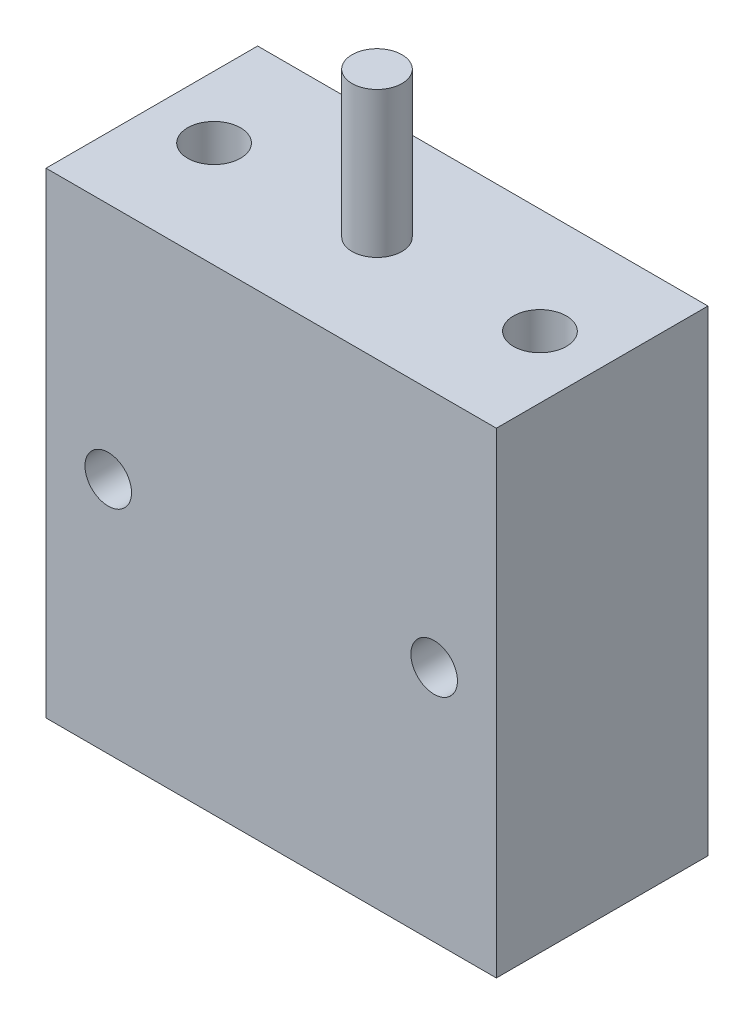
ISO-10303-21;
HEADER;
FILE_DESCRIPTION(('STEP AP214'),'2;1');
FILE_NAME('part.step','',(''),(''),'','','');
FILE_SCHEMA(('AUTOMOTIVE_DESIGN { 1 0 10303 214 1 1 1 1 }'));
ENDSEC;
DATA;
#1=APPLICATION_CONTEXT('core data for automotive mechanical design processes');
#2=APPLICATION_PROTOCOL_DEFINITION('international standard','automotive_design',2000,#1);
#3=PRODUCT_CONTEXT('',#1,'mechanical');
#4=PRODUCT('Part','Part','',(#3));
#5=PRODUCT_RELATED_PRODUCT_CATEGORY('part','',(#4));
#6=PRODUCT_DEFINITION_FORMATION('','',#4);
#7=PRODUCT_DEFINITION_CONTEXT('part definition',#1,'design');
#8=PRODUCT_DEFINITION('design','',#6,#7);
#9=PRODUCT_DEFINITION_SHAPE('','',#8);
#10=(LENGTH_UNIT() NAMED_UNIT(*) SI_UNIT(.MILLI.,.METRE.));
#11=(NAMED_UNIT(*) PLANE_ANGLE_UNIT() SI_UNIT($,.RADIAN.));
#12=(NAMED_UNIT(*) SI_UNIT($,.STERADIAN.) SOLID_ANGLE_UNIT());
#13=UNCERTAINTY_MEASURE_WITH_UNIT(LENGTH_MEASURE(1.E-05),#10,'distance_accuracy_value','');
#14=(GEOMETRIC_REPRESENTATION_CONTEXT(3) GLOBAL_UNCERTAINTY_ASSIGNED_CONTEXT((#13)) GLOBAL_UNIT_ASSIGNED_CONTEXT((#10,
#11,#12)) REPRESENTATION_CONTEXT('',''));
#15=CARTESIAN_POINT('',(0.,0.,0.));
#16=DIRECTION('',(0.,0.,1.));
#17=DIRECTION('',(1.,0.,0.));
#18=AXIS2_PLACEMENT_3D('',#15,#16,#17);
#19=CARTESIAN_POINT('',(-13.5128,38.5572,12.7));
#20=DIRECTION('',(0.,-1.,0.));
#21=DIRECTION('',(0.,0.,-1.));
#22=AXIS2_PLACEMENT_3D('',#19,#20,#21);
#23=PLANE('',#22);
#24=CARTESIAN_POINT('',(-9.779,38.5572,6.35));
#25=DIRECTION('',(0.,1.,0.));
#26=DIRECTION('',(0.,0.,-1.));
#27=AXIS2_PLACEMENT_3D('',#24,#25,#26);
#28=CIRCLE('',#27,1.5875);
#29=CARTESIAN_POINT('',(-9.779,38.5572,4.7625));
#30=VERTEX_POINT('',#29);
#31=EDGE_CURVE('E471',#30,#30,#28,.T.);
#32=ORIENTED_EDGE('',*,*,#31,.F.);
#33=EDGE_LOOP('',(#32));
#34=FACE_BOUND('',#33,.T.);
#35=CARTESIAN_POINT('',(9.779,38.5572,6.35));
#36=DIRECTION('',(0.,1.,0.));
#37=DIRECTION('',(0.,0.,1.));
#38=AXIS2_PLACEMENT_3D('',#35,#36,#37);
#39=CIRCLE('',#38,1.5875);
#40=CARTESIAN_POINT('',(9.779,38.5572,7.9375));
#41=VERTEX_POINT('',#40);
#42=EDGE_CURVE('E465',#41,#41,#39,.T.);
#43=ORIENTED_EDGE('',*,*,#42,.F.);
#44=EDGE_LOOP('',(#43));
#45=FACE_BOUND('',#44,.T.);
#46=DIRECTION('',(-1.,0.,0.));
#47=VECTOR('',#46,1.);
#48=CARTESIAN_POINT('',(-13.5128,38.5572,0.));
#49=LINE('',#48,#47);
#50=CARTESIAN_POINT('',(13.5128,38.5572,0.));
#51=VERTEX_POINT('',#50);
#52=CARTESIAN_POINT('',(-13.5128,38.5572,0.));
#53=VERTEX_POINT('',#52);
#54=EDGE_CURVE('E429',#51,#53,#49,.T.);
#55=ORIENTED_EDGE('',*,*,#54,.T.);
#56=DIRECTION('',(0.,0.,-1.));
#57=VECTOR('',#56,1.);
#58=CARTESIAN_POINT('',(-13.5128,38.5572,12.7));
#59=LINE('',#58,#57);
#60=CARTESIAN_POINT('',(-13.5128,38.5572,12.7));
#61=VERTEX_POINT('',#60);
#62=EDGE_CURVE('E420',#61,#53,#59,.T.);
#63=ORIENTED_EDGE('',*,*,#62,.F.);
#64=DIRECTION('',(-1.,0.,0.));
#65=VECTOR('',#64,1.);
#66=CARTESIAN_POINT('',(-13.5128,38.5572,12.7));
#67=LINE('',#66,#65);
#68=CARTESIAN_POINT('',(13.5128,38.5572,12.7));
#69=VERTEX_POINT('',#68);
#70=EDGE_CURVE('E375',#69,#61,#67,.T.);
#71=ORIENTED_EDGE('',*,*,#70,.F.);
#72=DIRECTION('',(0.,0.,-1.));
#73=VECTOR('',#72,1.);
#74=CARTESIAN_POINT('',(13.5128,38.5572,12.7));
#75=LINE('',#74,#73);
#76=EDGE_CURVE('E437',#69,#51,#75,.T.);
#77=ORIENTED_EDGE('',*,*,#76,.T.);
#78=EDGE_LOOP('',(#55,#63,#71,#77));
#79=FACE_BOUND('',#78,.T.);
#80=CARTESIAN_POINT('',(0.,38.5572,6.35));
#81=DIRECTION('',(0.,-1.,0.));
#82=DIRECTION('',(0.,0.,-1.));
#83=AXIS2_PLACEMENT_3D('',#80,#81,#82);
#84=CIRCLE('',#83,1.4986);
#85=CARTESIAN_POINT('',(0.,38.5572,4.8514));
#86=VERTEX_POINT('',#85);
#87=EDGE_CURVE('E11',#86,#86,#84,.F.);
#88=ORIENTED_EDGE('',*,*,#87,.F.);
#89=EDGE_LOOP('',(#88));
#90=FACE_BOUND('',#89,.T.);
#91=ADVANCED_FACE('F360',(#34,#45,#79,#90),#23,.F.);
#92=CARTESIAN_POINT('',(-13.5128,9.9822,12.7));
#93=DIRECTION('',(0.,0.,1.));
#94=DIRECTION('',(1.,0.,0.));
#95=AXIS2_PLACEMENT_3D('',#92,#93,#94);
#96=PLANE('',#95);
#97=CARTESIAN_POINT('',(-9.779,24.257,12.7));
#98=DIRECTION('',(0.,0.,1.));
#99=DIRECTION('',(1.,0.,0.));
#100=AXIS2_PLACEMENT_3D('',#97,#98,#99);
#101=CIRCLE('',#100,1.397);
#102=CARTESIAN_POINT('',(-8.382,24.257,12.7));
#103=VERTEX_POINT('',#102);
#104=EDGE_CURVE('E421',#103,#103,#101,.T.);
#105=ORIENTED_EDGE('',*,*,#104,.F.);
#106=EDGE_LOOP('',(#105));
#107=FACE_BOUND('',#106,.T.);
#108=DIRECTION('',(0.,-1.,0.));
#109=VECTOR('',#108,1.);
#110=CARTESIAN_POINT('',(-13.5128,38.5572,12.7));
#111=LINE('',#110,#109);
#112=CARTESIAN_POINT('',(-13.5128,9.9822,12.7));
#113=VERTEX_POINT('',#112);
#114=EDGE_CURVE('E431',#61,#113,#111,.T.);
#115=ORIENTED_EDGE('',*,*,#114,.T.);
#116=DIRECTION('',(1.,0.,0.));
#117=VECTOR('',#116,1.);
#118=CARTESIAN_POINT('',(-13.5128,9.9822,12.7));
#119=LINE('',#118,#117);
#120=CARTESIAN_POINT('',(13.5128,9.9822,12.7));
#121=VERTEX_POINT('',#120);
#122=EDGE_CURVE('E415',#113,#121,#119,.T.);
#123=ORIENTED_EDGE('',*,*,#122,.T.);
#124=DIRECTION('',(0.,1.,0.));
#125=VECTOR('',#124,1.);
#126=CARTESIAN_POINT('',(13.5128,38.5572,12.7));
#127=LINE('',#126,#125);
#128=EDGE_CURVE('E380',#121,#69,#127,.T.);
#129=ORIENTED_EDGE('',*,*,#128,.T.);
#130=ORIENTED_EDGE('',*,*,#70,.T.);
#131=EDGE_LOOP('',(#115,#123,#129,#130));
#132=FACE_BOUND('',#131,.T.);
#133=CARTESIAN_POINT('',(9.779,24.257,12.7));
#134=DIRECTION('',(0.,0.,1.));
#135=DIRECTION('',(1.,0.,0.));
#136=AXIS2_PLACEMENT_3D('',#133,#134,#135);
#137=CIRCLE('',#136,1.397);
#138=CARTESIAN_POINT('',(11.176,24.257,12.7));
#139=VERTEX_POINT('',#138);
#140=EDGE_CURVE('E451',#139,#139,#137,.T.);
#141=ORIENTED_EDGE('',*,*,#140,.F.);
#142=EDGE_LOOP('',(#141));
#143=FACE_BOUND('',#142,.T.);
#144=ADVANCED_FACE('F444',(#107,#132,#143),#96,.T.);
#145=CARTESIAN_POINT('',(-13.5128,9.9822,0.));
#146=DIRECTION('',(0.,0.,1.));
#147=DIRECTION('',(1.,0.,0.));
#148=AXIS2_PLACEMENT_3D('',#145,#146,#147);
#149=PLANE('',#148);
#150=CARTESIAN_POINT('',(-9.779,24.257,0.));
#151=DIRECTION('',(0.,0.,1.));
#152=DIRECTION('',(1.,0.,0.));
#153=AXIS2_PLACEMENT_3D('',#150,#151,#152);
#154=CIRCLE('',#153,1.397);
#155=CARTESIAN_POINT('',(-8.382,24.257,0.));
#156=VERTEX_POINT('',#155);
#157=EDGE_CURVE('E424',#156,#156,#154,.T.);
#158=ORIENTED_EDGE('',*,*,#157,.T.);
#159=EDGE_LOOP('',(#158));
#160=FACE_BOUND('',#159,.T.);
#161=DIRECTION('',(0.,-1.,0.));
#162=VECTOR('',#161,1.);
#163=CARTESIAN_POINT('',(-13.5128,38.5572,0.));
#164=LINE('',#163,#162);
#165=CARTESIAN_POINT('',(-13.5128,9.9822,0.));
#166=VERTEX_POINT('',#165);
#167=EDGE_CURVE('E407',#53,#166,#164,.T.);
#168=ORIENTED_EDGE('',*,*,#167,.F.);
#169=ORIENTED_EDGE('',*,*,#54,.F.);
#170=DIRECTION('',(0.,1.,0.));
#171=VECTOR('',#170,1.);
#172=CARTESIAN_POINT('',(13.5128,38.5572,0.));
#173=LINE('',#172,#171);
#174=CARTESIAN_POINT('',(13.5128,9.9822,0.));
#175=VERTEX_POINT('',#174);
#176=EDGE_CURVE('E408',#175,#51,#173,.T.);
#177=ORIENTED_EDGE('',*,*,#176,.F.);
#178=DIRECTION('',(1.,0.,0.));
#179=VECTOR('',#178,1.);
#180=CARTESIAN_POINT('',(-13.5128,9.9822,0.));
#181=LINE('',#180,#179);
#182=EDGE_CURVE('E401',#166,#175,#181,.T.);
#183=ORIENTED_EDGE('',*,*,#182,.F.);
#184=EDGE_LOOP('',(#168,#169,#177,#183));
#185=FACE_BOUND('',#184,.T.);
#186=CARTESIAN_POINT('',(9.779,24.257,0.));
#187=DIRECTION('',(0.,0.,1.));
#188=DIRECTION('',(1.,0.,0.));
#189=AXIS2_PLACEMENT_3D('',#186,#187,#188);
#190=CIRCLE('',#189,1.397);
#191=CARTESIAN_POINT('',(11.176,24.257,0.));
#192=VERTEX_POINT('',#191);
#193=EDGE_CURVE('E453',#192,#192,#190,.T.);
#194=ORIENTED_EDGE('',*,*,#193,.T.);
#195=EDGE_LOOP('',(#194));
#196=FACE_BOUND('',#195,.T.);
#197=ADVANCED_FACE('F403',(#160,#185,#196),#149,.F.);
#198=CARTESIAN_POINT('',(-13.5128,38.5572,12.7));
#199=DIRECTION('',(1.,0.,0.));
#200=DIRECTION('',(0.,1.,0.));
#201=AXIS2_PLACEMENT_3D('',#198,#199,#200);
#202=PLANE('',#201);
#203=ORIENTED_EDGE('',*,*,#167,.T.);
#204=DIRECTION('',(0.,0.,-1.));
#205=VECTOR('',#204,1.);
#206=CARTESIAN_POINT('',(-13.5128,9.9822,12.7));
#207=LINE('',#206,#205);
#208=EDGE_CURVE('E368',#113,#166,#207,.T.);
#209=ORIENTED_EDGE('',*,*,#208,.F.);
#210=ORIENTED_EDGE('',*,*,#114,.F.);
#211=ORIENTED_EDGE('',*,*,#62,.T.);
#212=EDGE_LOOP('',(#203,#209,#210,#211));
#213=FACE_BOUND('',#212,.T.);
#214=ADVANCED_FACE('F362',(#213),#202,.F.);
#215=CARTESIAN_POINT('',(-13.5128,9.9822,12.7));
#216=DIRECTION('',(0.,1.,0.));
#217=DIRECTION('',(0.,0.,1.));
#218=AXIS2_PLACEMENT_3D('',#215,#216,#217);
#219=PLANE('',#218);
#220=CARTESIAN_POINT('',(9.779,9.9822,6.35));
#221=DIRECTION('',(0.,-1.,0.));
#222=DIRECTION('',(0.,0.,-1.));
#223=AXIS2_PLACEMENT_3D('',#220,#221,#222);
#224=CIRCLE('',#223,1.5875);
#225=CARTESIAN_POINT('',(9.779,9.9822,4.7625));
#226=VERTEX_POINT('',#225);
#227=EDGE_CURVE('E483',#226,#226,#224,.T.);
#228=ORIENTED_EDGE('',*,*,#227,.F.);
#229=EDGE_LOOP('',(#228));
#230=FACE_BOUND('',#229,.T.);
#231=CARTESIAN_POINT('',(-9.779,9.9822,6.35));
#232=DIRECTION('',(0.,-1.,0.));
#233=DIRECTION('',(0.,0.,-1.));
#234=AXIS2_PLACEMENT_3D('',#231,#232,#233);
#235=CIRCLE('',#234,1.5875);
#236=CARTESIAN_POINT('',(-9.779,9.9822,4.7625));
#237=VERTEX_POINT('',#236);
#238=EDGE_CURVE('E477',#237,#237,#235,.T.);
#239=ORIENTED_EDGE('',*,*,#238,.F.);
#240=EDGE_LOOP('',(#239));
#241=FACE_BOUND('',#240,.T.);
#242=ORIENTED_EDGE('',*,*,#182,.T.);
#243=DIRECTION('',(0.,0.,-1.));
#244=VECTOR('',#243,1.);
#245=CARTESIAN_POINT('',(13.5128,9.9822,12.7));
#246=LINE('',#245,#244);
#247=EDGE_CURVE('E418',#121,#175,#246,.T.);
#248=ORIENTED_EDGE('',*,*,#247,.F.);
#249=ORIENTED_EDGE('',*,*,#122,.F.);
#250=ORIENTED_EDGE('',*,*,#208,.T.);
#251=EDGE_LOOP('',(#242,#248,#249,#250));
#252=FACE_BOUND('',#251,.T.);
#253=ADVANCED_FACE('F414',(#230,#241,#252),#219,.F.);
#254=CARTESIAN_POINT('',(13.5128,38.5572,12.7));
#255=DIRECTION('',(-1.,0.,0.));
#256=DIRECTION('',(0.,-1.,0.));
#257=AXIS2_PLACEMENT_3D('',#254,#255,#256);
#258=PLANE('',#257);
#259=ORIENTED_EDGE('',*,*,#176,.T.);
#260=ORIENTED_EDGE('',*,*,#76,.F.);
#261=ORIENTED_EDGE('',*,*,#128,.F.);
#262=ORIENTED_EDGE('',*,*,#247,.T.);
#263=EDGE_LOOP('',(#259,#260,#261,#262));
#264=FACE_BOUND('',#263,.T.);
#265=ADVANCED_FACE('F441',(#264),#258,.F.);
#266=CARTESIAN_POINT('',(-9.779,24.257,12.7));
#267=DIRECTION('',(0.,0.,-1.));
#268=DIRECTION('',(-1.,0.,0.));
#269=AXIS2_PLACEMENT_3D('',#266,#267,#268);
#270=CYLINDRICAL_SURFACE('',#269,1.397);
#271=ORIENTED_EDGE('',*,*,#104,.T.);
#272=EDGE_LOOP('',(#271));
#273=FACE_BOUND('',#272,.T.);
#274=ORIENTED_EDGE('',*,*,#157,.F.);
#275=EDGE_LOOP('',(#274));
#276=FACE_BOUND('',#275,.T.);
#277=ADVANCED_FACE('F519',(#273,#276),#270,.F.);
#278=CARTESIAN_POINT('',(9.779,24.257,12.7));
#279=DIRECTION('',(0.,0.,-1.));
#280=DIRECTION('',(-1.,0.,0.));
#281=AXIS2_PLACEMENT_3D('',#278,#279,#280);
#282=CYLINDRICAL_SURFACE('',#281,1.397);
#283=ORIENTED_EDGE('',*,*,#140,.T.);
#284=EDGE_LOOP('',(#283));
#285=FACE_BOUND('',#284,.T.);
#286=ORIENTED_EDGE('',*,*,#193,.F.);
#287=EDGE_LOOP('',(#286));
#288=FACE_BOUND('',#287,.T.);
#289=ADVANCED_FACE('F526',(#285,#288),#282,.F.);
#290=CARTESIAN_POINT('',(0.,47.28845,6.35));
#291=DIRECTION('',(0.,-1.,0.));
#292=DIRECTION('',(0.,0.,-1.));
#293=AXIS2_PLACEMENT_3D('',#290,#291,#292);
#294=CYLINDRICAL_SURFACE('',#293,1.4986);
#295=CARTESIAN_POINT('',(0.,47.28845,6.35));
#296=DIRECTION('',(0.,1.,0.));
#297=DIRECTION('',(0.,0.,1.));
#298=AXIS2_PLACEMENT_3D('',#295,#296,#297);
#299=CIRCLE('',#298,1.4986);
#300=CARTESIAN_POINT('',(0.,47.28845,7.8486));
#301=VERTEX_POINT('',#300);
#302=EDGE_CURVE('E457',#301,#301,#299,.T.);
#303=ORIENTED_EDGE('',*,*,#302,.F.);
#304=EDGE_LOOP('',(#303));
#305=FACE_BOUND('',#304,.T.);
#306=ORIENTED_EDGE('',*,*,#87,.T.);
#307=EDGE_LOOP('',(#306));
#308=FACE_BOUND('',#307,.T.);
#309=ADVANCED_FACE('F534',(#305,#308),#294,.T.);
#310=CARTESIAN_POINT('',(0.,47.28845,6.35));
#311=DIRECTION('',(0.,1.,0.));
#312=DIRECTION('',(0.,0.,1.));
#313=AXIS2_PLACEMENT_3D('',#310,#311,#312);
#314=PLANE('',#313);
#315=ORIENTED_EDGE('',*,*,#302,.T.);
#316=EDGE_LOOP('',(#315));
#317=FACE_BOUND('',#316,.T.);
#318=ADVANCED_FACE('F577',(#317),#314,.T.);
#319=CARTESIAN_POINT('',(9.779,31.41345,6.35));
#320=DIRECTION('',(0.,1.,0.));
#321=DIRECTION('',(0.,0.,1.));
#322=AXIS2_PLACEMENT_3D('',#319,#320,#321);
#323=CYLINDRICAL_SURFACE('',#322,1.5875);
#324=CARTESIAN_POINT('',(9.779,31.41345,6.35));
#325=DIRECTION('',(0.,1.,0.));
#326=DIRECTION('',(0.,0.,1.));
#327=AXIS2_PLACEMENT_3D('',#324,#325,#326);
#328=CIRCLE('',#327,1.5875);
#329=CARTESIAN_POINT('',(9.779,31.41345,7.9375));
#330=VERTEX_POINT('',#329);
#331=EDGE_CURVE('E462',#330,#330,#328,.T.);
#332=ORIENTED_EDGE('',*,*,#331,.F.);
#333=EDGE_LOOP('',(#332));
#334=FACE_BOUND('',#333,.T.);
#335=ORIENTED_EDGE('',*,*,#42,.T.);
#336=EDGE_LOOP('',(#335));
#337=FACE_BOUND('',#336,.T.);
#338=ADVANCED_FACE('F570',(#334,#337),#323,.F.);
#339=CARTESIAN_POINT('',(9.779,31.41345,6.35));
#340=DIRECTION('',(0.,1.,0.));
#341=DIRECTION('',(0.,0.,1.));
#342=AXIS2_PLACEMENT_3D('',#339,#340,#341);
#343=PLANE('',#342);
#344=ORIENTED_EDGE('',*,*,#331,.T.);
#345=EDGE_LOOP('',(#344));
#346=FACE_BOUND('',#345,.T.);
#347=ADVANCED_FACE('F561',(#346),#343,.T.);
#348=CARTESIAN_POINT('',(-9.779,31.41345,6.35));
#349=DIRECTION('',(0.,1.,0.));
#350=DIRECTION('',(0.,0.,1.));
#351=AXIS2_PLACEMENT_3D('',#348,#349,#350);
#352=CYLINDRICAL_SURFACE('',#351,1.5875);
#353=CARTESIAN_POINT('',(-9.779,31.41345,6.35));
#354=DIRECTION('',(0.,1.,0.));
#355=DIRECTION('',(0.,0.,-1.));
#356=AXIS2_PLACEMENT_3D('',#353,#354,#355);
#357=CIRCLE('',#356,1.5875);
#358=CARTESIAN_POINT('',(-9.779,31.41345,4.7625));
#359=VERTEX_POINT('',#358);
#360=EDGE_CURVE('E468',#359,#359,#357,.T.);
#361=ORIENTED_EDGE('',*,*,#360,.F.);
#362=EDGE_LOOP('',(#361));
#363=FACE_BOUND('',#362,.T.);
#364=ORIENTED_EDGE('',*,*,#31,.T.);
#365=EDGE_LOOP('',(#364));
#366=FACE_BOUND('',#365,.T.);
#367=ADVANCED_FACE('F505',(#363,#366),#352,.F.);
#368=CARTESIAN_POINT('',(-9.779,31.41345,6.35));
#369=DIRECTION('',(0.,-1.,0.));
#370=DIRECTION('',(0.,0.,-1.));
#371=AXIS2_PLACEMENT_3D('',#368,#369,#370);
#372=PLANE('',#371);
#373=ORIENTED_EDGE('',*,*,#360,.T.);
#374=EDGE_LOOP('',(#373));
#375=FACE_BOUND('',#374,.T.);
#376=ADVANCED_FACE('F496',(#375),#372,.F.);
#377=CARTESIAN_POINT('',(-9.779,17.12595,6.35));
#378=DIRECTION('',(0.,-1.,0.));
#379=DIRECTION('',(0.,0.,-1.));
#380=AXIS2_PLACEMENT_3D('',#377,#378,#379);
#381=CYLINDRICAL_SURFACE('',#380,1.5875);
#382=CARTESIAN_POINT('',(-9.779,17.12595,6.35));
#383=DIRECTION('',(0.,-1.,0.));
#384=DIRECTION('',(0.,0.,-1.));
#385=AXIS2_PLACEMENT_3D('',#382,#383,#384);
#386=CIRCLE('',#385,1.5875);
#387=CARTESIAN_POINT('',(-9.779,17.12595,4.7625));
#388=VERTEX_POINT('',#387);
#389=EDGE_CURVE('E474',#388,#388,#386,.T.);
#390=ORIENTED_EDGE('',*,*,#389,.F.);
#391=EDGE_LOOP('',(#390));
#392=FACE_BOUND('',#391,.T.);
#393=ORIENTED_EDGE('',*,*,#238,.T.);
#394=EDGE_LOOP('',(#393));
#395=FACE_BOUND('',#394,.T.);
#396=ADVANCED_FACE('F493',(#392,#395),#381,.F.);
#397=CARTESIAN_POINT('',(-9.779,17.12595,6.35));
#398=DIRECTION('',(0.,-1.,0.));
#399=DIRECTION('',(0.,0.,-1.));
#400=AXIS2_PLACEMENT_3D('',#397,#398,#399);
#401=PLANE('',#400);
#402=ORIENTED_EDGE('',*,*,#389,.T.);
#403=EDGE_LOOP('',(#402));
#404=FACE_BOUND('',#403,.T.);
#405=ADVANCED_FACE('F495',(#404),#401,.T.);
#406=CARTESIAN_POINT('',(9.779,17.12595,6.35));
#407=DIRECTION('',(0.,-1.,0.));
#408=DIRECTION('',(0.,0.,-1.));
#409=AXIS2_PLACEMENT_3D('',#406,#407,#408);
#410=CYLINDRICAL_SURFACE('',#409,1.5875);
#411=CARTESIAN_POINT('',(9.779,17.12595,6.35));
#412=DIRECTION('',(0.,-1.,0.));
#413=DIRECTION('',(0.,0.,-1.));
#414=AXIS2_PLACEMENT_3D('',#411,#412,#413);
#415=CIRCLE('',#414,1.5875);
#416=CARTESIAN_POINT('',(9.779,17.12595,4.7625));
#417=VERTEX_POINT('',#416);
#418=EDGE_CURVE('E480',#417,#417,#415,.T.);
#419=ORIENTED_EDGE('',*,*,#418,.F.);
#420=EDGE_LOOP('',(#419));
#421=FACE_BOUND('',#420,.T.);
#422=ORIENTED_EDGE('',*,*,#227,.T.);
#423=EDGE_LOOP('',(#422));
#424=FACE_BOUND('',#423,.T.);
#425=ADVANCED_FACE('F487',(#421,#424),#410,.F.);
#426=CARTESIAN_POINT('',(9.779,17.12595,6.35));
#427=DIRECTION('',(0.,-1.,0.));
#428=DIRECTION('',(0.,0.,-1.));
#429=AXIS2_PLACEMENT_3D('',#426,#427,#428);
#430=PLANE('',#429);
#431=ORIENTED_EDGE('',*,*,#418,.T.);
#432=EDGE_LOOP('',(#431));
#433=FACE_BOUND('',#432,.T.);
#434=ADVANCED_FACE('F628',(#433),#430,.T.);
#435=CLOSED_SHELL('',(#91,#144,#197,#214,#253,#265,#277,#289,#309,#318,#338,#347,#367,#376,#396,
#405,#425,#434));
#436=MANIFOLD_SOLID_BREP('B2',#435);
#437=ADVANCED_BREP_SHAPE_REPRESENTATION('',(#18,#436),#14);
#438=SHAPE_DEFINITION_REPRESENTATION(#9,#437);
ENDSEC;
END-ISO-10303-21;
